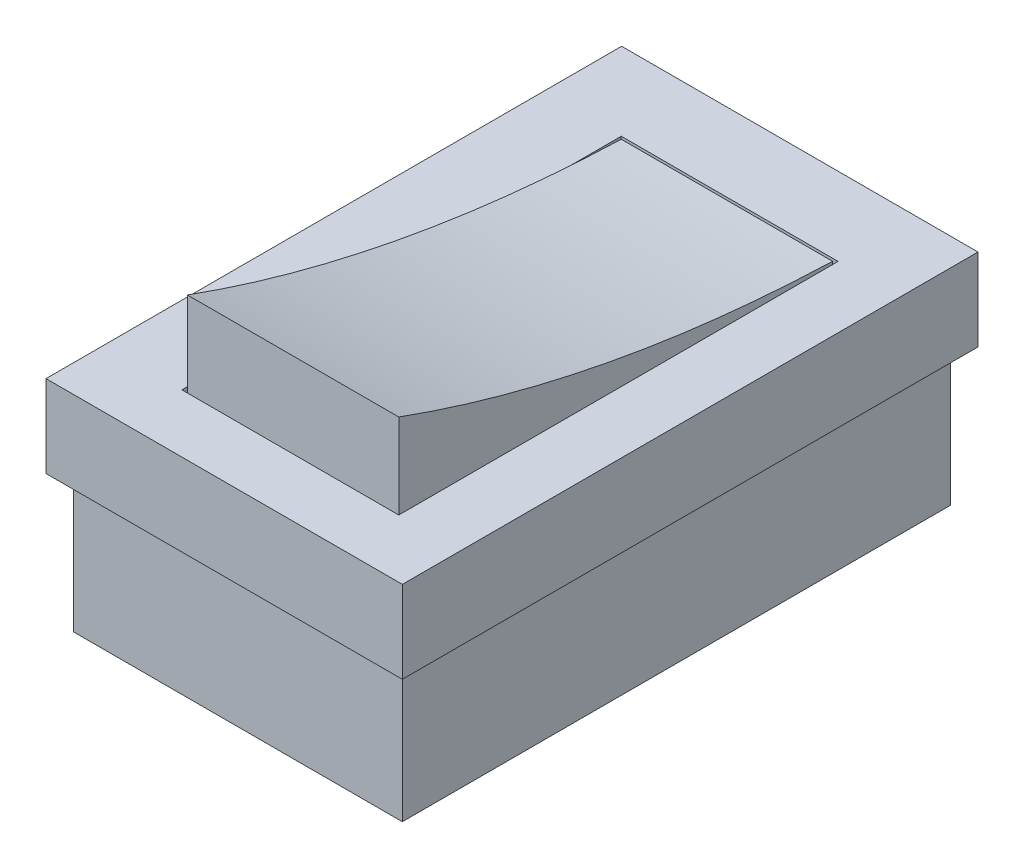
ISO-10303-21;
HEADER;
FILE_DESCRIPTION(('STEP AP214'),'2;1');
FILE_NAME('part.step','',(''),(''),'','','');
FILE_SCHEMA(('AUTOMOTIVE_DESIGN { 1 0 10303 214 1 1 1 1 }'));
ENDSEC;
DATA;
#1=APPLICATION_CONTEXT('core data for automotive mechanical design processes');
#2=APPLICATION_PROTOCOL_DEFINITION('international standard','automotive_design',2000,#1);
#3=PRODUCT_CONTEXT('',#1,'mechanical');
#4=PRODUCT('Part','Part','',(#3));
#5=PRODUCT_RELATED_PRODUCT_CATEGORY('part','',(#4));
#6=PRODUCT_DEFINITION_FORMATION('','',#4);
#7=PRODUCT_DEFINITION_CONTEXT('part definition',#1,'design');
#8=PRODUCT_DEFINITION('design','',#6,#7);
#9=PRODUCT_DEFINITION_SHAPE('','',#8);
#10=(LENGTH_UNIT() NAMED_UNIT(*) SI_UNIT(.MILLI.,.METRE.));
#11=(NAMED_UNIT(*) PLANE_ANGLE_UNIT() SI_UNIT($,.RADIAN.));
#12=(NAMED_UNIT(*) SI_UNIT($,.STERADIAN.) SOLID_ANGLE_UNIT());
#13=UNCERTAINTY_MEASURE_WITH_UNIT(LENGTH_MEASURE(1.E-05),#10,'distance_accuracy_value','');
#14=(GEOMETRIC_REPRESENTATION_CONTEXT(3) GLOBAL_UNCERTAINTY_ASSIGNED_CONTEXT((#13)) GLOBAL_UNIT_ASSIGNED_CONTEXT((#10,
#11,#12)) REPRESENTATION_CONTEXT('',''));
#15=CARTESIAN_POINT('',(0.,0.,0.));
#16=DIRECTION('',(0.,0.,1.));
#17=DIRECTION('',(1.,0.,0.));
#18=AXIS2_PLACEMENT_3D('',#15,#16,#17);
#19=CARTESIAN_POINT('',(-3.83338840452123,0.,-7.95296521391464));
#20=DIRECTION('',(-1.,0.,0.));
#21=DIRECTION('',(0.,0.,1.));
#22=AXIS2_PLACEMENT_3D('',#19,#20,#21);
#23=PLANE('',#22);
#24=DIRECTION('',(0.,1.,0.));
#25=VECTOR('',#24,1.);
#26=CARTESIAN_POINT('',(-3.83338840452123,0.,7.87300720048651));
#27=LINE('',#26,#25);
#28=CARTESIAN_POINT('',(-3.83338840452123,0.,7.87300720048651));
#29=VERTEX_POINT('',#28);
#30=CARTESIAN_POINT('',(-3.83338840452123,5.99751606770288,7.87300720048651));
#31=VERTEX_POINT('',#30);
#32=EDGE_CURVE('E172',#29,#31,#27,.T.);
#33=ORIENTED_EDGE('',*,*,#32,.T.);
#34=CARTESIAN_POINT('',(-3.83338840452123,3.00275282457078,-7.980636765355));
#35=CARTESIAN_POINT('',(-3.83338840452123,3.29032680372889,0.516128494464672));
#36=CARTESIAN_POINT('',(-3.83338840452123,6.04850647692219,8.01225260649923));
#37=B_SPLINE_CURVE_WITH_KNOTS('',2,(#34,#35,#36),.UNSPECIFIED.,.F.,.F.,(3,3),(0.,1.),.UNSPECIFIED.);
#38=CARTESIAN_POINT('',(-3.83338840452123,3.00369601331914,-7.95296521391464));
#39=VERTEX_POINT('',#38);
#40=EDGE_CURVE('E52',#31,#39,#37,.F.);
#41=ORIENTED_EDGE('',*,*,#40,.T.);
#42=DIRECTION('',(0.,1.,0.));
#43=VECTOR('',#42,1.);
#44=CARTESIAN_POINT('',(-3.83338840452123,0.,-7.95296521391464));
#45=LINE('',#44,#43);
#46=CARTESIAN_POINT('',(-3.83338840452123,0.,-7.95296521391464));
#47=VERTEX_POINT('',#46);
#48=EDGE_CURVE('E164',#47,#39,#45,.T.);
#49=ORIENTED_EDGE('',*,*,#48,.F.);
#50=DIRECTION('',(0.,0.,1.));
#51=VECTOR('',#50,1.);
#52=CARTESIAN_POINT('',(-3.83338840452123,0.,-7.95296521391464));
#53=LINE('',#52,#51);
#54=EDGE_CURVE('E458',#47,#29,#53,.T.);
#55=ORIENTED_EDGE('',*,*,#54,.T.);
#56=EDGE_LOOP('',(#33,#41,#49,#55));
#57=FACE_BOUND('',#56,.T.);
#58=ADVANCED_FACE('F37',(#57),#23,.T.);
#59=CARTESIAN_POINT('',(3.87670072044343,0.,-7.95296521391464));
#60=DIRECTION('',(0.,0.,-1.));
#61=DIRECTION('',(-1.,0.,0.));
#62=AXIS2_PLACEMENT_3D('',#59,#60,#61);
#63=PLANE('',#62);
#64=ORIENTED_EDGE('',*,*,#48,.T.);
#65=DIRECTION('',(1.,0.,0.));
#66=VECTOR('',#65,1.);
#67=CARTESIAN_POINT('',(-6.76819681666162,3.00369601331914,-7.95296521391464));
#68=LINE('',#67,#66);
#69=CARTESIAN_POINT('',(3.87670072044343,3.00369601331914,-7.95296521391464));
#70=VERTEX_POINT('',#69);
#71=EDGE_CURVE('E151',#39,#70,#68,.T.);
#72=ORIENTED_EDGE('',*,*,#71,.T.);
#73=DIRECTION('',(0.,1.,0.));
#74=VECTOR('',#73,1.);
#75=CARTESIAN_POINT('',(3.87670072044343,0.,-7.95296521391464));
#76=LINE('',#75,#74);
#77=CARTESIAN_POINT('',(3.87670072044343,0.,-7.95296521391464));
#78=VERTEX_POINT('',#77);
#79=EDGE_CURVE('E162',#78,#70,#76,.T.);
#80=ORIENTED_EDGE('',*,*,#79,.F.);
#81=DIRECTION('',(-1.,0.,0.));
#82=VECTOR('',#81,1.);
#83=CARTESIAN_POINT('',(3.87670072044343,0.,-7.95296521391464));
#84=LINE('',#83,#82);
#85=EDGE_CURVE('E178',#78,#47,#84,.T.);
#86=ORIENTED_EDGE('',*,*,#85,.T.);
#87=EDGE_LOOP('',(#64,#72,#80,#86));
#88=FACE_BOUND('',#87,.T.);
#89=ADVANCED_FACE('F160',(#88),#63,.T.);
#90=CARTESIAN_POINT('',(3.87670072044343,0.,-7.95296521391464));
#91=DIRECTION('',(1.,0.,0.));
#92=DIRECTION('',(0.,0.,-1.));
#93=AXIS2_PLACEMENT_3D('',#90,#91,#92);
#94=PLANE('',#93);
#95=ORIENTED_EDGE('',*,*,#79,.T.);
#96=CARTESIAN_POINT('',(3.87670072044343,3.00275282457078,-7.980636765355));
#97=CARTESIAN_POINT('',(3.87670072044343,3.29032680372889,0.516128494464672));
#98=CARTESIAN_POINT('',(3.87670072044343,6.04850647692219,8.01225260649923));
#99=B_SPLINE_CURVE_WITH_KNOTS('',2,(#96,#97,#98),.UNSPECIFIED.,.F.,.F.,(3,3),(0.,1.),.UNSPECIFIED.);
#100=CARTESIAN_POINT('',(3.87670072044343,5.99751606541532,7.87300720048651));
#101=VERTEX_POINT('',#100);
#102=EDGE_CURVE('E148',#70,#101,#99,.T.);
#103=ORIENTED_EDGE('',*,*,#102,.T.);
#104=DIRECTION('',(0.,1.,0.));
#105=VECTOR('',#104,1.);
#106=CARTESIAN_POINT('',(3.87670072044343,0.,7.87300720048651));
#107=LINE('',#106,#105);
#108=CARTESIAN_POINT('',(3.87670072044343,0.,7.87300720048651));
#109=VERTEX_POINT('',#108);
#110=EDGE_CURVE('E169',#109,#101,#107,.T.);
#111=ORIENTED_EDGE('',*,*,#110,.F.);
#112=DIRECTION('',(0.,0.,-1.));
#113=VECTOR('',#112,1.);
#114=CARTESIAN_POINT('',(3.87670072044343,0.,-7.95296521391464));
#115=LINE('',#114,#113);
#116=EDGE_CURVE('E168',#109,#78,#115,.T.);
#117=ORIENTED_EDGE('',*,*,#116,.T.);
#118=EDGE_LOOP('',(#95,#103,#111,#117));
#119=FACE_BOUND('',#118,.T.);
#120=ADVANCED_FACE('F167',(#119),#94,.T.);
#121=CARTESIAN_POINT('',(3.87670072044343,0.,7.87300720048651));
#122=DIRECTION('',(0.,0.,1.));
#123=DIRECTION('',(1.,0.,0.));
#124=AXIS2_PLACEMENT_3D('',#121,#122,#123);
#125=PLANE('',#124);
#126=ORIENTED_EDGE('',*,*,#110,.T.);
#127=DIRECTION('',(1.,0.,0.));
#128=VECTOR('',#127,1.);
#129=CARTESIAN_POINT('',(-6.76819681666162,5.99751606541532,7.87300720048651));
#130=LINE('',#129,#128);
#131=EDGE_CURVE('E152',#31,#101,#130,.T.);
#132=ORIENTED_EDGE('',*,*,#131,.F.);
#133=ORIENTED_EDGE('',*,*,#32,.F.);
#134=DIRECTION('',(1.,0.,0.));
#135=VECTOR('',#134,1.);
#136=CARTESIAN_POINT('',(3.87670072044343,0.,7.87300720048651));
#137=LINE('',#136,#135);
#138=EDGE_CURVE('E464',#29,#109,#137,.T.);
#139=ORIENTED_EDGE('',*,*,#138,.T.);
#140=EDGE_LOOP('',(#126,#132,#133,#139));
#141=FACE_BOUND('',#140,.T.);
#142=ADVANCED_FACE('F303',(#141),#125,.T.);
#143=CARTESIAN_POINT('',(0.,3.,0.));
#144=DIRECTION('',(0.,-1.,0.));
#145=DIRECTION('',(0.,0.,-1.));
#146=AXIS2_PLACEMENT_3D('',#143,#144,#145);
#147=PLANE('',#146);
#148=DIRECTION('',(-1.,0.,0.));
#149=VECTOR('',#148,1.);
#150=CARTESIAN_POINT('',(3.97670072044343,3.,-8.05296521391464));
#151=LINE('',#150,#149);
#152=CARTESIAN_POINT('',(3.97670072044343,3.,-8.05296521391464));
#153=VERTEX_POINT('',#152);
#154=CARTESIAN_POINT('',(-3.93338840452123,3.,-8.05296521391464));
#155=VERTEX_POINT('',#154);
#156=EDGE_CURVE('E194',#153,#155,#151,.T.);
#157=ORIENTED_EDGE('',*,*,#156,.F.);
#158=DIRECTION('',(0.,0.,-1.));
#159=VECTOR('',#158,1.);
#160=CARTESIAN_POINT('',(3.97670072044343,3.,-8.05296521391464));
#161=LINE('',#160,#159);
#162=CARTESIAN_POINT('',(3.97670072044343,3.,7.97300720048651));
#163=VERTEX_POINT('',#162);
#164=EDGE_CURVE('E60',#163,#153,#161,.T.);
#165=ORIENTED_EDGE('',*,*,#164,.F.);
#166=DIRECTION('',(1.,0.,0.));
#167=VECTOR('',#166,1.);
#168=CARTESIAN_POINT('',(3.97670072044343,3.,7.97300720048651));
#169=LINE('',#168,#167);
#170=CARTESIAN_POINT('',(-3.93338840452123,3.,7.97300720048651));
#171=VERTEX_POINT('',#170);
#172=EDGE_CURVE('E183',#171,#163,#169,.T.);
#173=ORIENTED_EDGE('',*,*,#172,.F.);
#174=DIRECTION('',(0.,0.,1.));
#175=VECTOR('',#174,1.);
#176=CARTESIAN_POINT('',(-3.93338840452123,3.,-8.05296521391464));
#177=LINE('',#176,#175);
#178=EDGE_CURVE('E197',#155,#171,#177,.T.);
#179=ORIENTED_EDGE('',*,*,#178,.F.);
#180=EDGE_LOOP('',(#157,#165,#173,#179));
#181=FACE_BOUND('',#180,.T.);
#182=DIRECTION('',(0.,0.,-1.));
#183=VECTOR('',#182,1.);
#184=CARTESIAN_POINT('',(6.23180318333837,3.,-10.9022952249925));
#185=LINE('',#184,#183);
#186=CARTESIAN_POINT('',(6.23180318333837,3.,10.0977047750075));
#187=VERTEX_POINT('',#186);
#188=CARTESIAN_POINT('',(6.23180318333837,3.,-10.9022952249925));
#189=VERTEX_POINT('',#188);
#190=EDGE_CURVE('E243',#187,#189,#185,.T.);
#191=ORIENTED_EDGE('',*,*,#190,.T.);
#192=DIRECTION('',(-1.,0.,0.));
#193=VECTOR('',#192,1.);
#194=CARTESIAN_POINT('',(6.23180318333837,3.,-10.9022952249925));
#195=LINE('',#194,#193);
#196=CARTESIAN_POINT('',(-6.76819681666162,3.,-10.9022952249925));
#197=VERTEX_POINT('',#196);
#198=EDGE_CURVE('E246',#189,#197,#195,.T.);
#199=ORIENTED_EDGE('',*,*,#198,.T.);
#200=DIRECTION('',(0.,0.,1.));
#201=VECTOR('',#200,1.);
#202=CARTESIAN_POINT('',(-6.76819681666162,3.,-10.9022952249925));
#203=LINE('',#202,#201);
#204=CARTESIAN_POINT('',(-6.76819681666163,3.,10.0977047750075));
#205=VERTEX_POINT('',#204);
#206=EDGE_CURVE('E249',#197,#205,#203,.T.);
#207=ORIENTED_EDGE('',*,*,#206,.T.);
#208=DIRECTION('',(1.,0.,0.));
#209=VECTOR('',#208,1.);
#210=CARTESIAN_POINT('',(6.23180318333837,3.,10.0977047750075));
#211=LINE('',#210,#209);
#212=EDGE_CURVE('E251',#205,#187,#211,.T.);
#213=ORIENTED_EDGE('',*,*,#212,.T.);
#214=EDGE_LOOP('',(#191,#199,#207,#213));
#215=FACE_BOUND('',#214,.T.);
#216=ADVANCED_FACE('F286',(#181,#215),#147,.F.);
#217=CARTESIAN_POINT('',(0.,0.,0.));
#218=DIRECTION('',(0.,-1.,0.));
#219=DIRECTION('',(0.,0.,-1.));
#220=AXIS2_PLACEMENT_3D('',#217,#218,#219);
#221=PLANE('',#220);
#222=DIRECTION('',(0.,0.,-1.));
#223=VECTOR('',#222,1.);
#224=CARTESIAN_POINT('',(6.23180318333837,0.,-10.9022952249925));
#225=LINE('',#224,#223);
#226=CARTESIAN_POINT('',(6.23180318333837,0.,10.0977047750075));
#227=VERTEX_POINT('',#226);
#228=CARTESIAN_POINT('',(6.23180318333837,0.,-10.9022952249925));
#229=VERTEX_POINT('',#228);
#230=EDGE_CURVE('E242',#227,#229,#225,.T.);
#231=ORIENTED_EDGE('',*,*,#230,.F.);
#232=DIRECTION('',(1.,0.,0.));
#233=VECTOR('',#232,1.);
#234=CARTESIAN_POINT('',(6.23180318333837,0.,10.0977047750075));
#235=LINE('',#234,#233);
#236=CARTESIAN_POINT('',(-6.76819681666163,0.,10.0977047750075));
#237=VERTEX_POINT('',#236);
#238=EDGE_CURVE('E247',#237,#227,#235,.T.);
#239=ORIENTED_EDGE('',*,*,#238,.F.);
#240=DIRECTION('',(0.,0.,1.));
#241=VECTOR('',#240,1.);
#242=CARTESIAN_POINT('',(-6.76819681666162,0.,-10.9022952249925));
#243=LINE('',#242,#241);
#244=CARTESIAN_POINT('',(-6.76819681666162,0.,-10.9022952249925));
#245=VERTEX_POINT('',#244);
#246=EDGE_CURVE('E258',#245,#237,#243,.T.);
#247=ORIENTED_EDGE('',*,*,#246,.F.);
#248=DIRECTION('',(-1.,0.,0.));
#249=VECTOR('',#248,1.);
#250=CARTESIAN_POINT('',(6.23180318333837,0.,-10.9022952249925));
#251=LINE('',#250,#249);
#252=EDGE_CURVE('E256',#229,#245,#251,.T.);
#253=ORIENTED_EDGE('',*,*,#252,.F.);
#254=EDGE_LOOP('',(#231,#239,#247,#253));
#255=FACE_BOUND('',#254,.T.);
#256=DIRECTION('',(-1.,0.,0.));
#257=VECTOR('',#256,1.);
#258=CARTESIAN_POINT('',(5.73180318333838,0.,-10.4022952249925));
#259=LINE('',#258,#257);
#260=CARTESIAN_POINT('',(5.73180318333838,0.,-10.4022952249925));
#261=VERTEX_POINT('',#260);
#262=CARTESIAN_POINT('',(-6.26819681666162,0.,-10.4022952249925));
#263=VERTEX_POINT('',#262);
#264=EDGE_CURVE('E239',#261,#263,#259,.T.);
#265=ORIENTED_EDGE('',*,*,#264,.T.);
#266=DIRECTION('',(0.,0.,1.));
#267=VECTOR('',#266,1.);
#268=CARTESIAN_POINT('',(-6.26819681666162,0.,-10.4022952249925));
#269=LINE('',#268,#267);
#270=CARTESIAN_POINT('',(-6.26819681666162,0.,9.59770477500755));
#271=VERTEX_POINT('',#270);
#272=EDGE_CURVE('E223',#263,#271,#269,.T.);
#273=ORIENTED_EDGE('',*,*,#272,.T.);
#274=DIRECTION('',(1.,0.,0.));
#275=VECTOR('',#274,1.);
#276=CARTESIAN_POINT('',(5.73180318333838,0.,9.59770477500755));
#277=LINE('',#276,#275);
#278=CARTESIAN_POINT('',(5.73180318333838,0.,9.59770477500755));
#279=VERTEX_POINT('',#278);
#280=EDGE_CURVE('E233',#271,#279,#277,.T.);
#281=ORIENTED_EDGE('',*,*,#280,.T.);
#282=DIRECTION('',(0.,0.,-1.));
#283=VECTOR('',#282,1.);
#284=CARTESIAN_POINT('',(5.73180318333838,0.,-10.4022952249925));
#285=LINE('',#284,#283);
#286=EDGE_CURVE('E236',#279,#261,#285,.T.);
#287=ORIENTED_EDGE('',*,*,#286,.T.);
#288=EDGE_LOOP('',(#265,#273,#281,#287));
#289=FACE_BOUND('',#288,.T.);
#290=ADVANCED_FACE('F276',(#255,#289),#221,.T.);
#291=CARTESIAN_POINT('',(6.23180318333837,3.,-10.9022952249925));
#292=DIRECTION('',(-1.,0.,0.));
#293=DIRECTION('',(0.,0.,1.));
#294=AXIS2_PLACEMENT_3D('',#291,#292,#293);
#295=PLANE('',#294);
#296=ORIENTED_EDGE('',*,*,#230,.T.);
#297=DIRECTION('',(0.,-1.,0.));
#298=VECTOR('',#297,1.);
#299=CARTESIAN_POINT('',(6.23180318333837,3.,-10.9022952249925));
#300=LINE('',#299,#298);
#301=EDGE_CURVE('E11',#189,#229,#300,.T.);
#302=ORIENTED_EDGE('',*,*,#301,.F.);
#303=ORIENTED_EDGE('',*,*,#190,.F.);
#304=DIRECTION('',(0.,-1.,0.));
#305=VECTOR('',#304,1.);
#306=CARTESIAN_POINT('',(6.23180318333837,3.,10.0977047750075));
#307=LINE('',#306,#305);
#308=EDGE_CURVE('E253',#187,#227,#307,.T.);
#309=ORIENTED_EDGE('',*,*,#308,.T.);
#310=EDGE_LOOP('',(#296,#302,#303,#309));
#311=FACE_BOUND('',#310,.T.);
#312=ADVANCED_FACE('F39',(#311),#295,.F.);
#313=CARTESIAN_POINT('',(6.23180318333837,3.,-10.9022952249925));
#314=DIRECTION('',(0.,0.,1.));
#315=DIRECTION('',(1.,0.,0.));
#316=AXIS2_PLACEMENT_3D('',#313,#314,#315);
#317=PLANE('',#316);
#318=ORIENTED_EDGE('',*,*,#252,.T.);
#319=DIRECTION('',(0.,-1.,0.));
#320=VECTOR('',#319,1.);
#321=CARTESIAN_POINT('',(-6.76819681666162,3.,-10.9022952249925));
#322=LINE('',#321,#320);
#323=EDGE_CURVE('E45',#197,#245,#322,.T.);
#324=ORIENTED_EDGE('',*,*,#323,.F.);
#325=ORIENTED_EDGE('',*,*,#198,.F.);
#326=ORIENTED_EDGE('',*,*,#301,.T.);
#327=EDGE_LOOP('',(#318,#324,#325,#326));
#328=FACE_BOUND('',#327,.T.);
#329=ADVANCED_FACE('F287',(#328),#317,.F.);
#330=CARTESIAN_POINT('',(-6.76819681666162,3.,-10.9022952249925));
#331=DIRECTION('',(1.,0.,0.));
#332=DIRECTION('',(0.,0.,-1.));
#333=AXIS2_PLACEMENT_3D('',#330,#331,#332);
#334=PLANE('',#333);
#335=ORIENTED_EDGE('',*,*,#246,.T.);
#336=DIRECTION('',(0.,-1.,0.));
#337=VECTOR('',#336,1.);
#338=CARTESIAN_POINT('',(-6.76819681666163,3.,10.0977047750075));
#339=LINE('',#338,#337);
#340=EDGE_CURVE('E263',#205,#237,#339,.T.);
#341=ORIENTED_EDGE('',*,*,#340,.F.);
#342=ORIENTED_EDGE('',*,*,#206,.F.);
#343=ORIENTED_EDGE('',*,*,#323,.T.);
#344=EDGE_LOOP('',(#335,#341,#342,#343));
#345=FACE_BOUND('',#344,.T.);
#346=ADVANCED_FACE('F270',(#345),#334,.F.);
#347=CARTESIAN_POINT('',(6.23180318333837,3.,10.0977047750075));
#348=DIRECTION('',(0.,0.,-1.));
#349=DIRECTION('',(-1.,0.,0.));
#350=AXIS2_PLACEMENT_3D('',#347,#348,#349);
#351=PLANE('',#350);
#352=ORIENTED_EDGE('',*,*,#238,.T.);
#353=ORIENTED_EDGE('',*,*,#308,.F.);
#354=ORIENTED_EDGE('',*,*,#212,.F.);
#355=ORIENTED_EDGE('',*,*,#340,.T.);
#356=EDGE_LOOP('',(#352,#353,#354,#355));
#357=FACE_BOUND('',#356,.T.);
#358=ADVANCED_FACE('F280',(#357),#351,.F.);
#359=CARTESIAN_POINT('',(0.,-5.,-10.4022952249925));
#360=DIRECTION('',(0.,0.,-1.));
#361=DIRECTION('',(-1.,0.,0.));
#362=AXIS2_PLACEMENT_3D('',#359,#360,#361);
#363=PLANE('',#362);
#364=DIRECTION('',(0.,1.,0.));
#365=VECTOR('',#364,1.);
#366=CARTESIAN_POINT('',(-6.26819681666162,-5.,-10.4022952249925));
#367=LINE('',#366,#365);
#368=CARTESIAN_POINT('',(-6.26819681666162,-5.,-10.4022952249925));
#369=VERTEX_POINT('',#368);
#370=EDGE_CURVE('E219',#369,#263,#367,.T.);
#371=ORIENTED_EDGE('',*,*,#370,.T.);
#372=ORIENTED_EDGE('',*,*,#264,.F.);
#373=DIRECTION('',(0.,1.,0.));
#374=VECTOR('',#373,1.);
#375=CARTESIAN_POINT('',(5.73180318333838,-5.,-10.4022952249925));
#376=LINE('',#375,#374);
#377=CARTESIAN_POINT('',(5.73180318333838,-5.,-10.4022952249925));
#378=VERTEX_POINT('',#377);
#379=EDGE_CURVE('E220',#378,#261,#376,.T.);
#380=ORIENTED_EDGE('',*,*,#379,.F.);
#381=DIRECTION('',(-1.,0.,0.));
#382=VECTOR('',#381,1.);
#383=CARTESIAN_POINT('',(0.,-5.,-10.4022952249925));
#384=LINE('',#383,#382);
#385=EDGE_CURVE('E204',#378,#369,#384,.T.);
#386=ORIENTED_EDGE('',*,*,#385,.T.);
#387=EDGE_LOOP('',(#371,#372,#380,#386));
#388=FACE_BOUND('',#387,.T.);
#389=ADVANCED_FACE('F333',(#388),#363,.T.);
#390=CARTESIAN_POINT('',(5.73180318333838,-5.,0.));
#391=DIRECTION('',(-1.,0.,0.));
#392=DIRECTION('',(0.,0.,1.));
#393=AXIS2_PLACEMENT_3D('',#390,#391,#392);
#394=PLANE('',#393);
#395=ORIENTED_EDGE('',*,*,#286,.F.);
#396=DIRECTION('',(0.,1.,0.));
#397=VECTOR('',#396,1.);
#398=CARTESIAN_POINT('',(5.73180318333838,-5.,9.59770477500755));
#399=LINE('',#398,#397);
#400=CARTESIAN_POINT('',(5.73180318333838,-5.,9.59770477500755));
#401=VERTEX_POINT('',#400);
#402=EDGE_CURVE('E224',#401,#279,#399,.T.);
#403=ORIENTED_EDGE('',*,*,#402,.F.);
#404=DIRECTION('',(0.,0.,1.));
#405=VECTOR('',#404,1.);
#406=CARTESIAN_POINT('',(5.73180318333838,-5.,0.));
#407=LINE('',#406,#405);
#408=EDGE_CURVE('E217',#378,#401,#407,.T.);
#409=ORIENTED_EDGE('',*,*,#408,.F.);
#410=ORIENTED_EDGE('',*,*,#379,.T.);
#411=EDGE_LOOP('',(#395,#403,#409,#410));
#412=FACE_BOUND('',#411,.T.);
#413=ADVANCED_FACE('F329',(#412),#394,.F.);
#414=CARTESIAN_POINT('',(0.,-5.,9.59770477500755));
#415=DIRECTION('',(0.,0.,-1.));
#416=DIRECTION('',(-1.,0.,0.));
#417=AXIS2_PLACEMENT_3D('',#414,#415,#416);
#418=PLANE('',#417);
#419=ORIENTED_EDGE('',*,*,#280,.F.);
#420=DIRECTION('',(0.,1.,0.));
#421=VECTOR('',#420,1.);
#422=CARTESIAN_POINT('',(-6.26819681666162,-5.,9.59770477500755));
#423=LINE('',#422,#421);
#424=CARTESIAN_POINT('',(-6.26819681666162,-5.,9.59770477500755));
#425=VERTEX_POINT('',#424);
#426=EDGE_CURVE('E227',#425,#271,#423,.T.);
#427=ORIENTED_EDGE('',*,*,#426,.F.);
#428=DIRECTION('',(-1.,0.,0.));
#429=VECTOR('',#428,1.);
#430=CARTESIAN_POINT('',(0.,-5.,9.59770477500755));
#431=LINE('',#430,#429);
#432=EDGE_CURVE('E215',#401,#425,#431,.T.);
#433=ORIENTED_EDGE('',*,*,#432,.F.);
#434=ORIENTED_EDGE('',*,*,#402,.T.);
#435=EDGE_LOOP('',(#419,#427,#433,#434));
#436=FACE_BOUND('',#435,.T.);
#437=ADVANCED_FACE('F332',(#436),#418,.F.);
#438=CARTESIAN_POINT('',(-6.26819681666162,-5.,0.));
#439=DIRECTION('',(-1.,0.,0.));
#440=DIRECTION('',(0.,0.,1.));
#441=AXIS2_PLACEMENT_3D('',#438,#439,#440);
#442=PLANE('',#441);
#443=ORIENTED_EDGE('',*,*,#426,.T.);
#444=ORIENTED_EDGE('',*,*,#272,.F.);
#445=ORIENTED_EDGE('',*,*,#370,.F.);
#446=DIRECTION('',(0.,0.,1.));
#447=VECTOR('',#446,1.);
#448=CARTESIAN_POINT('',(-6.26819681666162,-5.,0.));
#449=LINE('',#448,#447);
#450=EDGE_CURVE('E212',#369,#425,#449,.T.);
#451=ORIENTED_EDGE('',*,*,#450,.T.);
#452=EDGE_LOOP('',(#443,#444,#445,#451));
#453=FACE_BOUND('',#452,.T.);
#454=ADVANCED_FACE('F327',(#453),#442,.T.);
#455=CARTESIAN_POINT('',(0.,-5.,0.));
#456=DIRECTION('',(0.,1.,0.));
#457=DIRECTION('',(0.,0.,1.));
#458=AXIS2_PLACEMENT_3D('',#455,#456,#457);
#459=PLANE('',#458);
#460=ORIENTED_EDGE('',*,*,#385,.F.);
#461=ORIENTED_EDGE('',*,*,#408,.T.);
#462=ORIENTED_EDGE('',*,*,#432,.T.);
#463=ORIENTED_EDGE('',*,*,#450,.F.);
#464=EDGE_LOOP('',(#460,#461,#462,#463));
#465=FACE_BOUND('',#464,.T.);
#466=ADVANCED_FACE('F324',(#465),#459,.F.);
#467=CARTESIAN_POINT('',(3.97670072044343,0.,-8.05296521391464));
#468=DIRECTION('',(1.,0.,0.));
#469=DIRECTION('',(0.,0.,-1.));
#470=AXIS2_PLACEMENT_3D('',#467,#468,#469);
#471=PLANE('',#470);
#472=ORIENTED_EDGE('',*,*,#164,.T.);
#473=DIRECTION('',(0.,1.,0.));
#474=VECTOR('',#473,1.);
#475=CARTESIAN_POINT('',(3.97670072044343,0.,-8.05296521391464));
#476=LINE('',#475,#474);
#477=CARTESIAN_POINT('',(3.97670072044343,0.,-8.05296521391464));
#478=VERTEX_POINT('',#477);
#479=EDGE_CURVE('E192',#478,#153,#476,.T.);
#480=ORIENTED_EDGE('',*,*,#479,.F.);
#481=DIRECTION('',(0.,0.,-1.));
#482=VECTOR('',#481,1.);
#483=CARTESIAN_POINT('',(3.97670072044343,0.,-8.05296521391464));
#484=LINE('',#483,#482);
#485=CARTESIAN_POINT('',(3.97670072044343,0.,7.97300720048651));
#486=VERTEX_POINT('',#485);
#487=EDGE_CURVE('E179',#486,#478,#484,.T.);
#488=ORIENTED_EDGE('',*,*,#487,.F.);
#489=DIRECTION('',(0.,1.,0.));
#490=VECTOR('',#489,1.);
#491=CARTESIAN_POINT('',(3.97670072044343,0.,7.97300720048651));
#492=LINE('',#491,#490);
#493=EDGE_CURVE('E202',#486,#163,#492,.T.);
#494=ORIENTED_EDGE('',*,*,#493,.T.);
#495=EDGE_LOOP('',(#472,#480,#488,#494));
#496=FACE_BOUND('',#495,.T.);
#497=ADVANCED_FACE('F314',(#496),#471,.F.);
#498=CARTESIAN_POINT('',(3.97670072044343,0.,7.97300720048651));
#499=DIRECTION('',(0.,0.,1.));
#500=DIRECTION('',(1.,0.,0.));
#501=AXIS2_PLACEMENT_3D('',#498,#499,#500);
#502=PLANE('',#501);
#503=ORIENTED_EDGE('',*,*,#172,.T.);
#504=ORIENTED_EDGE('',*,*,#493,.F.);
#505=DIRECTION('',(1.,0.,0.));
#506=VECTOR('',#505,1.);
#507=CARTESIAN_POINT('',(3.97670072044343,0.,7.97300720048651));
#508=LINE('',#507,#506);
#509=CARTESIAN_POINT('',(-3.93338840452123,0.,7.97300720048651));
#510=VERTEX_POINT('',#509);
#511=EDGE_CURVE('E189',#510,#486,#508,.T.);
#512=ORIENTED_EDGE('',*,*,#511,.F.);
#513=DIRECTION('',(0.,1.,0.));
#514=VECTOR('',#513,1.);
#515=CARTESIAN_POINT('',(-3.93338840452123,0.,7.97300720048651));
#516=LINE('',#515,#514);
#517=EDGE_CURVE('E205',#510,#171,#516,.T.);
#518=ORIENTED_EDGE('',*,*,#517,.T.);
#519=EDGE_LOOP('',(#503,#504,#512,#518));
#520=FACE_BOUND('',#519,.T.);
#521=ADVANCED_FACE('F310',(#520),#502,.F.);
#522=CARTESIAN_POINT('',(-3.93338840452123,0.,-8.05296521391464));
#523=DIRECTION('',(-1.,0.,0.));
#524=DIRECTION('',(0.,0.,1.));
#525=AXIS2_PLACEMENT_3D('',#522,#523,#524);
#526=PLANE('',#525);
#527=ORIENTED_EDGE('',*,*,#178,.T.);
#528=ORIENTED_EDGE('',*,*,#517,.F.);
#529=DIRECTION('',(0.,0.,1.));
#530=VECTOR('',#529,1.);
#531=CARTESIAN_POINT('',(-3.93338840452123,0.,-8.05296521391464));
#532=LINE('',#531,#530);
#533=CARTESIAN_POINT('',(-3.93338840452123,0.,-8.05296521391464));
#534=VERTEX_POINT('',#533);
#535=EDGE_CURVE('E186',#534,#510,#532,.T.);
#536=ORIENTED_EDGE('',*,*,#535,.F.);
#537=DIRECTION('',(0.,1.,0.));
#538=VECTOR('',#537,1.);
#539=CARTESIAN_POINT('',(-3.93338840452123,0.,-8.05296521391464));
#540=LINE('',#539,#538);
#541=EDGE_CURVE('E207',#534,#155,#540,.T.);
#542=ORIENTED_EDGE('',*,*,#541,.T.);
#543=EDGE_LOOP('',(#527,#528,#536,#542));
#544=FACE_BOUND('',#543,.T.);
#545=ADVANCED_FACE('F313',(#544),#526,.F.);
#546=CARTESIAN_POINT('',(3.97670072044343,0.,-8.05296521391464));
#547=DIRECTION('',(0.,0.,-1.));
#548=DIRECTION('',(-1.,0.,0.));
#549=AXIS2_PLACEMENT_3D('',#546,#547,#548);
#550=PLANE('',#549);
#551=ORIENTED_EDGE('',*,*,#156,.T.);
#552=ORIENTED_EDGE('',*,*,#541,.F.);
#553=DIRECTION('',(-1.,0.,0.));
#554=VECTOR('',#553,1.);
#555=CARTESIAN_POINT('',(3.97670072044343,0.,-8.05296521391464));
#556=LINE('',#555,#554);
#557=EDGE_CURVE('E182',#478,#534,#556,.T.);
#558=ORIENTED_EDGE('',*,*,#557,.F.);
#559=ORIENTED_EDGE('',*,*,#479,.T.);
#560=EDGE_LOOP('',(#551,#552,#558,#559));
#561=FACE_BOUND('',#560,.T.);
#562=ADVANCED_FACE('F308',(#561),#550,.F.);
#563=CARTESIAN_POINT('',(0.,0.,0.));
#564=DIRECTION('',(0.,-1.,0.));
#565=DIRECTION('',(0.,0.,-1.));
#566=AXIS2_PLACEMENT_3D('',#563,#564,#565);
#567=PLANE('',#566);
#568=ORIENTED_EDGE('',*,*,#54,.F.);
#569=ORIENTED_EDGE('',*,*,#85,.F.);
#570=ORIENTED_EDGE('',*,*,#116,.F.);
#571=ORIENTED_EDGE('',*,*,#138,.F.);
#572=EDGE_LOOP('',(#568,#569,#570,#571));
#573=FACE_BOUND('',#572,.T.);
#574=ORIENTED_EDGE('',*,*,#487,.T.);
#575=ORIENTED_EDGE('',*,*,#557,.T.);
#576=ORIENTED_EDGE('',*,*,#535,.T.);
#577=ORIENTED_EDGE('',*,*,#511,.T.);
#578=EDGE_LOOP('',(#574,#575,#576,#577));
#579=FACE_BOUND('',#578,.T.);
#580=ADVANCED_FACE('F305',(#573,#579),#567,.F.);
#581=CARTESIAN_POINT('',(-6.76819681666162,3.00275282457078,-7.980636765355));
#582=CARTESIAN_POINT('',(-6.76819681666162,3.29032680372889,0.516128494464672));
#583=CARTESIAN_POINT('',(-6.76819681666162,6.04850647692219,8.01225260649923));
#584=B_SPLINE_CURVE_WITH_KNOTS('',2,(#581,#582,#583),.UNSPECIFIED.,.F.,.F.,(3,3),(0.,1.),.UNSPECIFIED.);
#585=DIRECTION('',(1.,0.,0.));
#586=VECTOR('',#585,1.);
#587=SURFACE_OF_LINEAR_EXTRUSION('',#584,#586);
#588=ORIENTED_EDGE('',*,*,#131,.T.);
#589=ORIENTED_EDGE('',*,*,#102,.F.);
#590=ORIENTED_EDGE('',*,*,#71,.F.);
#591=ORIENTED_EDGE('',*,*,#40,.F.);
#592=EDGE_LOOP('',(#588,#589,#590,#591));
#593=FACE_BOUND('',#592,.T.);
#594=ADVANCED_FACE('F150',(#593),#587,.T.);
#595=CLOSED_SHELL('',(#58,#89,#120,#142,#216,#290,#312,#329,#346,#358,#389,#413,#437,#454,#466,
#497,#521,#545,#562,#580,#594));
#596=MANIFOLD_SOLID_BREP('B2',#595);
#597=ADVANCED_BREP_SHAPE_REPRESENTATION('',(#18,#596),#14);
#598=SHAPE_DEFINITION_REPRESENTATION(#9,#597);
ENDSEC;
END-ISO-10303-21;
